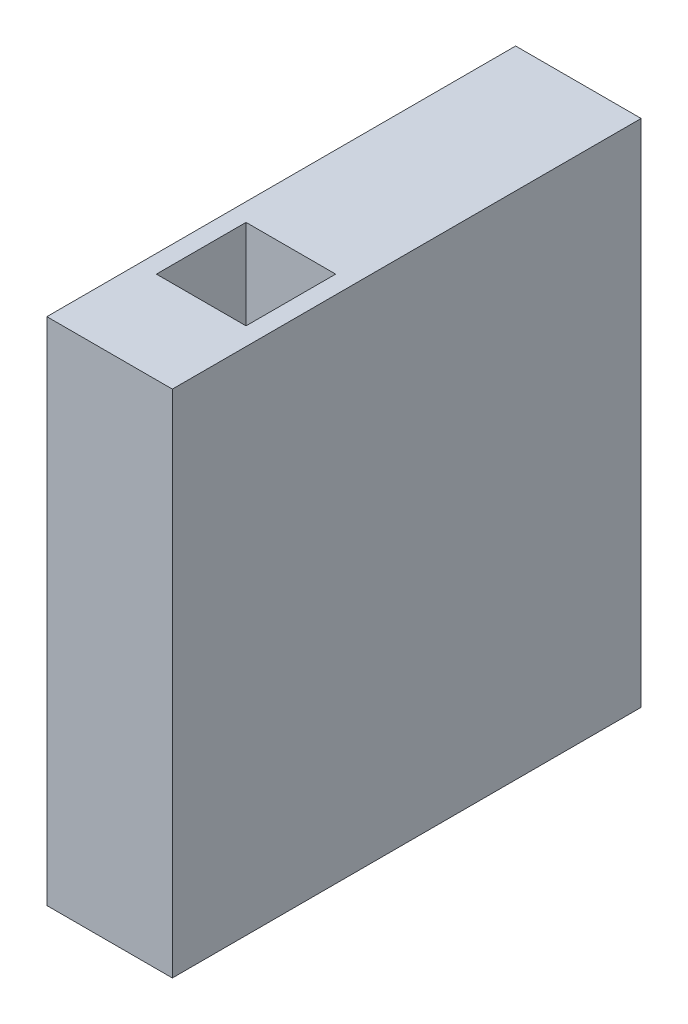
ISO-10303-21;
HEADER;
FILE_DESCRIPTION(('STEP AP214'),'2;1');
FILE_NAME('part.step','',(''),(''),'','','');
FILE_SCHEMA(('AUTOMOTIVE_DESIGN { 1 0 10303 214 1 1 1 1 }'));
ENDSEC;
DATA;
#1=APPLICATION_CONTEXT('core data for automotive mechanical design processes');
#2=APPLICATION_PROTOCOL_DEFINITION('international standard','automotive_design',2000,#1);
#3=PRODUCT_CONTEXT('',#1,'mechanical');
#4=PRODUCT('Part','Part','',(#3));
#5=PRODUCT_RELATED_PRODUCT_CATEGORY('part','',(#4));
#6=PRODUCT_DEFINITION_FORMATION('','',#4);
#7=PRODUCT_DEFINITION_CONTEXT('part definition',#1,'design');
#8=PRODUCT_DEFINITION('design','',#6,#7);
#9=PRODUCT_DEFINITION_SHAPE('','',#8);
#10=(LENGTH_UNIT() NAMED_UNIT(*) SI_UNIT(.MILLI.,.METRE.));
#11=(NAMED_UNIT(*) PLANE_ANGLE_UNIT() SI_UNIT($,.RADIAN.));
#12=(NAMED_UNIT(*) SI_UNIT($,.STERADIAN.) SOLID_ANGLE_UNIT());
#13=UNCERTAINTY_MEASURE_WITH_UNIT(LENGTH_MEASURE(1.E-05),#10,'distance_accuracy_value','');
#14=(GEOMETRIC_REPRESENTATION_CONTEXT(3) GLOBAL_UNCERTAINTY_ASSIGNED_CONTEXT((#13)) GLOBAL_UNIT_ASSIGNED_CONTEXT((#10,
#11,#12)) REPRESENTATION_CONTEXT('',''));
#15=CARTESIAN_POINT('',(0.,0.,0.));
#16=DIRECTION('',(0.,0.,1.));
#17=DIRECTION('',(1.,0.,0.));
#18=AXIS2_PLACEMENT_3D('',#15,#16,#17);
#19=CARTESIAN_POINT('',(0.,56.9,0.));
#20=DIRECTION('',(0.,1.,0.));
#21=DIRECTION('',(0.,0.,1.));
#22=AXIS2_PLACEMENT_3D('',#19,#20,#21);
#23=PLANE('',#22);
#24=DIRECTION('',(0.,0.,-1.));
#25=VECTOR('',#24,1.);
#26=CARTESIAN_POINT('',(7.,56.9,-26.15));
#27=LINE('',#26,#25);
#28=CARTESIAN_POINT('',(7.,56.9,26.15));
#29=VERTEX_POINT('',#28);
#30=CARTESIAN_POINT('',(7.,56.9,-26.15));
#31=VERTEX_POINT('',#30);
#32=EDGE_CURVE('E136',#29,#31,#27,.T.);
#33=ORIENTED_EDGE('',*,*,#32,.T.);
#34=DIRECTION('',(-1.,0.,0.));
#35=VECTOR('',#34,1.);
#36=CARTESIAN_POINT('',(-7.,56.9,-26.15));
#37=LINE('',#36,#35);
#38=CARTESIAN_POINT('',(-7.,56.9,-26.15));
#39=VERTEX_POINT('',#38);
#40=EDGE_CURVE('E139',#31,#39,#37,.T.);
#41=ORIENTED_EDGE('',*,*,#40,.T.);
#42=DIRECTION('',(0.,0.,1.));
#43=VECTOR('',#42,1.);
#44=CARTESIAN_POINT('',(-7.,56.9,-26.15));
#45=LINE('',#44,#43);
#46=CARTESIAN_POINT('',(-7.,56.9,26.15));
#47=VERTEX_POINT('',#46);
#48=EDGE_CURVE('E142',#39,#47,#45,.T.);
#49=ORIENTED_EDGE('',*,*,#48,.T.);
#50=DIRECTION('',(1.,0.,0.));
#51=VECTOR('',#50,1.);
#52=CARTESIAN_POINT('',(-7.,56.9,26.15));
#53=LINE('',#52,#51);
#54=EDGE_CURVE('E144',#47,#29,#53,.T.);
#55=ORIENTED_EDGE('',*,*,#54,.T.);
#56=EDGE_LOOP('',(#33,#41,#49,#55));
#57=FACE_BOUND('',#56,.T.);
#58=DIRECTION('',(1.,0.,0.));
#59=VECTOR('',#58,1.);
#60=CARTESIAN_POINT('',(0.,56.9,5.93));
#61=LINE('',#60,#59);
#62=CARTESIAN_POINT('',(-5.,56.9,5.93));
#63=VERTEX_POINT('',#62);
#64=CARTESIAN_POINT('',(5.,56.9,5.93));
#65=VERTEX_POINT('',#64);
#66=EDGE_CURVE('E126',#63,#65,#61,.T.);
#67=ORIENTED_EDGE('',*,*,#66,.T.);
#68=DIRECTION('',(0.,0.,1.));
#69=VECTOR('',#68,1.);
#70=CARTESIAN_POINT('',(5.,56.9,0.));
#71=LINE('',#70,#69);
#72=CARTESIAN_POINT('',(5.,56.9,15.93));
#73=VERTEX_POINT('',#72);
#74=EDGE_CURVE('E50',#65,#73,#71,.T.);
#75=ORIENTED_EDGE('',*,*,#74,.T.);
#76=DIRECTION('',(1.,0.,0.));
#77=VECTOR('',#76,1.);
#78=CARTESIAN_POINT('',(0.,56.9,15.93));
#79=LINE('',#78,#77);
#80=CARTESIAN_POINT('',(-5.,56.9,15.93));
#81=VERTEX_POINT('',#80);
#82=EDGE_CURVE('E117',#81,#73,#79,.T.);
#83=ORIENTED_EDGE('',*,*,#82,.F.);
#84=DIRECTION('',(0.,0.,1.));
#85=VECTOR('',#84,1.);
#86=CARTESIAN_POINT('',(-5.,56.9,0.));
#87=LINE('',#86,#85);
#88=EDGE_CURVE('E120',#63,#81,#87,.T.);
#89=ORIENTED_EDGE('',*,*,#88,.F.);
#90=EDGE_LOOP('',(#67,#75,#83,#89));
#91=FACE_BOUND('',#90,.T.);
#92=ADVANCED_FACE('F35',(#57,#91),#23,.T.);
#93=CARTESIAN_POINT('',(0.,0.,0.));
#94=DIRECTION('',(0.,1.,0.));
#95=DIRECTION('',(0.,0.,1.));
#96=AXIS2_PLACEMENT_3D('',#93,#94,#95);
#97=PLANE('',#96);
#98=DIRECTION('',(0.,0.,-1.));
#99=VECTOR('',#98,1.);
#100=CARTESIAN_POINT('',(7.,0.,-26.15));
#101=LINE('',#100,#99);
#102=CARTESIAN_POINT('',(7.,0.,26.15));
#103=VERTEX_POINT('',#102);
#104=CARTESIAN_POINT('',(7.,0.,-26.15));
#105=VERTEX_POINT('',#104);
#106=EDGE_CURVE('E132',#103,#105,#101,.T.);
#107=ORIENTED_EDGE('',*,*,#106,.F.);
#108=DIRECTION('',(1.,0.,0.));
#109=VECTOR('',#108,1.);
#110=CARTESIAN_POINT('',(-7.,0.,26.15));
#111=LINE('',#110,#109);
#112=CARTESIAN_POINT('',(-7.,0.,26.15));
#113=VERTEX_POINT('',#112);
#114=EDGE_CURVE('E140',#113,#103,#111,.T.);
#115=ORIENTED_EDGE('',*,*,#114,.F.);
#116=DIRECTION('',(0.,0.,1.));
#117=VECTOR('',#116,1.);
#118=CARTESIAN_POINT('',(-7.,0.,-26.15));
#119=LINE('',#118,#117);
#120=CARTESIAN_POINT('',(-7.,0.,-26.15));
#121=VERTEX_POINT('',#120);
#122=EDGE_CURVE('E151',#121,#113,#119,.T.);
#123=ORIENTED_EDGE('',*,*,#122,.F.);
#124=DIRECTION('',(-1.,0.,0.));
#125=VECTOR('',#124,1.);
#126=CARTESIAN_POINT('',(-7.,0.,-26.15));
#127=LINE('',#126,#125);
#128=EDGE_CURVE('E149',#105,#121,#127,.T.);
#129=ORIENTED_EDGE('',*,*,#128,.F.);
#130=EDGE_LOOP('',(#107,#115,#123,#129));
#131=FACE_BOUND('',#130,.T.);
#132=DIRECTION('',(0.,0.,1.));
#133=VECTOR('',#132,1.);
#134=CARTESIAN_POINT('',(5.,0.,0.));
#135=LINE('',#134,#133);
#136=CARTESIAN_POINT('',(5.,0.,5.93));
#137=VERTEX_POINT('',#136);
#138=CARTESIAN_POINT('',(5.,0.,15.93));
#139=VERTEX_POINT('',#138);
#140=EDGE_CURVE('E108',#137,#139,#135,.T.);
#141=ORIENTED_EDGE('',*,*,#140,.F.);
#142=DIRECTION('',(1.,0.,0.));
#143=VECTOR('',#142,1.);
#144=CARTESIAN_POINT('',(0.,0.,5.93));
#145=LINE('',#144,#143);
#146=CARTESIAN_POINT('',(-5.,0.,5.93));
#147=VERTEX_POINT('',#146);
#148=EDGE_CURVE('E100',#147,#137,#145,.T.);
#149=ORIENTED_EDGE('',*,*,#148,.F.);
#150=DIRECTION('',(0.,0.,1.));
#151=VECTOR('',#150,1.);
#152=CARTESIAN_POINT('',(-5.,0.,0.));
#153=LINE('',#152,#151);
#154=CARTESIAN_POINT('',(-5.,0.,15.93));
#155=VERTEX_POINT('',#154);
#156=EDGE_CURVE('E58',#147,#155,#153,.T.);
#157=ORIENTED_EDGE('',*,*,#156,.T.);
#158=DIRECTION('',(1.,0.,0.));
#159=VECTOR('',#158,1.);
#160=CARTESIAN_POINT('',(0.,0.,15.93));
#161=LINE('',#160,#159);
#162=EDGE_CURVE('E112',#155,#139,#161,.T.);
#163=ORIENTED_EDGE('',*,*,#162,.T.);
#164=EDGE_LOOP('',(#141,#149,#157,#163));
#165=FACE_BOUND('',#164,.T.);
#166=ADVANCED_FACE('F115',(#131,#165),#97,.F.);
#167=CARTESIAN_POINT('',(7.,56.9,-26.15));
#168=DIRECTION('',(-1.,0.,0.));
#169=DIRECTION('',(0.,0.,1.));
#170=AXIS2_PLACEMENT_3D('',#167,#168,#169);
#171=PLANE('',#170);
#172=ORIENTED_EDGE('',*,*,#106,.T.);
#173=DIRECTION('',(0.,-1.,0.));
#174=VECTOR('',#173,1.);
#175=CARTESIAN_POINT('',(7.,56.9,-26.15));
#176=LINE('',#175,#174);
#177=EDGE_CURVE('E11',#31,#105,#176,.T.);
#178=ORIENTED_EDGE('',*,*,#177,.F.);
#179=ORIENTED_EDGE('',*,*,#32,.F.);
#180=DIRECTION('',(0.,-1.,0.));
#181=VECTOR('',#180,1.);
#182=CARTESIAN_POINT('',(7.,56.9,26.15));
#183=LINE('',#182,#181);
#184=EDGE_CURVE('E146',#29,#103,#183,.T.);
#185=ORIENTED_EDGE('',*,*,#184,.T.);
#186=EDGE_LOOP('',(#172,#178,#179,#185));
#187=FACE_BOUND('',#186,.T.);
#188=ADVANCED_FACE('F37',(#187),#171,.F.);
#189=CARTESIAN_POINT('',(-7.,56.9,-26.15));
#190=DIRECTION('',(0.,0.,1.));
#191=DIRECTION('',(1.,0.,0.));
#192=AXIS2_PLACEMENT_3D('',#189,#190,#191);
#193=PLANE('',#192);
#194=ORIENTED_EDGE('',*,*,#128,.T.);
#195=DIRECTION('',(0.,-1.,0.));
#196=VECTOR('',#195,1.);
#197=CARTESIAN_POINT('',(-7.,56.9,-26.15));
#198=LINE('',#197,#196);
#199=EDGE_CURVE('E43',#39,#121,#198,.T.);
#200=ORIENTED_EDGE('',*,*,#199,.F.);
#201=ORIENTED_EDGE('',*,*,#40,.F.);
#202=ORIENTED_EDGE('',*,*,#177,.T.);
#203=EDGE_LOOP('',(#194,#200,#201,#202));
#204=FACE_BOUND('',#203,.T.);
#205=ADVANCED_FACE('F178',(#204),#193,.F.);
#206=CARTESIAN_POINT('',(-7.,56.9,-26.15));
#207=DIRECTION('',(1.,0.,0.));
#208=DIRECTION('',(0.,0.,-1.));
#209=AXIS2_PLACEMENT_3D('',#206,#207,#208);
#210=PLANE('',#209);
#211=ORIENTED_EDGE('',*,*,#122,.T.);
#212=DIRECTION('',(0.,-1.,0.));
#213=VECTOR('',#212,1.);
#214=CARTESIAN_POINT('',(-7.,56.9,26.15));
#215=LINE('',#214,#213);
#216=EDGE_CURVE('E156',#47,#113,#215,.T.);
#217=ORIENTED_EDGE('',*,*,#216,.F.);
#218=ORIENTED_EDGE('',*,*,#48,.F.);
#219=ORIENTED_EDGE('',*,*,#199,.T.);
#220=EDGE_LOOP('',(#211,#217,#218,#219));
#221=FACE_BOUND('',#220,.T.);
#222=ADVANCED_FACE('F163',(#221),#210,.F.);
#223=CARTESIAN_POINT('',(-7.,56.9,26.15));
#224=DIRECTION('',(0.,0.,-1.));
#225=DIRECTION('',(-1.,0.,0.));
#226=AXIS2_PLACEMENT_3D('',#223,#224,#225);
#227=PLANE('',#226);
#228=ORIENTED_EDGE('',*,*,#114,.T.);
#229=ORIENTED_EDGE('',*,*,#184,.F.);
#230=ORIENTED_EDGE('',*,*,#54,.F.);
#231=ORIENTED_EDGE('',*,*,#216,.T.);
#232=EDGE_LOOP('',(#228,#229,#230,#231));
#233=FACE_BOUND('',#232,.T.);
#234=ADVANCED_FACE('F171',(#233),#227,.F.);
#235=CARTESIAN_POINT('',(5.,0.,0.));
#236=DIRECTION('',(-1.,0.,0.));
#237=DIRECTION('',(0.,0.,1.));
#238=AXIS2_PLACEMENT_3D('',#235,#236,#237);
#239=PLANE('',#238);
#240=ORIENTED_EDGE('',*,*,#74,.F.);
#241=DIRECTION('',(0.,1.,0.));
#242=VECTOR('',#241,1.);
#243=CARTESIAN_POINT('',(5.,0.,5.93));
#244=LINE('',#243,#242);
#245=EDGE_CURVE('E103',#137,#65,#244,.T.);
#246=ORIENTED_EDGE('',*,*,#245,.F.);
#247=ORIENTED_EDGE('',*,*,#140,.T.);
#248=DIRECTION('',(0.,1.,0.));
#249=VECTOR('',#248,1.);
#250=CARTESIAN_POINT('',(5.,0.,15.93));
#251=LINE('',#250,#249);
#252=EDGE_CURVE('E130',#139,#73,#251,.T.);
#253=ORIENTED_EDGE('',*,*,#252,.T.);
#254=EDGE_LOOP('',(#240,#246,#247,#253));
#255=FACE_BOUND('',#254,.T.);
#256=ADVANCED_FACE('F110',(#255),#239,.T.);
#257=CARTESIAN_POINT('',(0.,0.,15.93));
#258=DIRECTION('',(0.,0.,1.));
#259=DIRECTION('',(1.,0.,0.));
#260=AXIS2_PLACEMENT_3D('',#257,#258,#259);
#261=PLANE('',#260);
#262=ORIENTED_EDGE('',*,*,#82,.T.);
#263=ORIENTED_EDGE('',*,*,#252,.F.);
#264=ORIENTED_EDGE('',*,*,#162,.F.);
#265=DIRECTION('',(0.,1.,0.));
#266=VECTOR('',#265,1.);
#267=CARTESIAN_POINT('',(-5.,0.,15.93));
#268=LINE('',#267,#266);
#269=EDGE_CURVE('E133',#155,#81,#268,.T.);
#270=ORIENTED_EDGE('',*,*,#269,.T.);
#271=EDGE_LOOP('',(#262,#263,#264,#270));
#272=FACE_BOUND('',#271,.T.);
#273=ADVANCED_FACE('F198',(#272),#261,.F.);
#274=CARTESIAN_POINT('',(-5.,0.,0.));
#275=DIRECTION('',(-1.,0.,0.));
#276=DIRECTION('',(0.,0.,1.));
#277=AXIS2_PLACEMENT_3D('',#274,#275,#276);
#278=PLANE('',#277);
#279=ORIENTED_EDGE('',*,*,#88,.T.);
#280=ORIENTED_EDGE('',*,*,#269,.F.);
#281=ORIENTED_EDGE('',*,*,#156,.F.);
#282=DIRECTION('',(0.,1.,0.));
#283=VECTOR('',#282,1.);
#284=CARTESIAN_POINT('',(-5.,0.,5.93));
#285=LINE('',#284,#283);
#286=EDGE_CURVE('E105',#147,#63,#285,.T.);
#287=ORIENTED_EDGE('',*,*,#286,.T.);
#288=EDGE_LOOP('',(#279,#280,#281,#287));
#289=FACE_BOUND('',#288,.T.);
#290=ADVANCED_FACE('F202',(#289),#278,.F.);
#291=CARTESIAN_POINT('',(0.,0.,5.93));
#292=DIRECTION('',(0.,0.,1.));
#293=DIRECTION('',(1.,0.,0.));
#294=AXIS2_PLACEMENT_3D('',#291,#292,#293);
#295=PLANE('',#294);
#296=ORIENTED_EDGE('',*,*,#66,.F.);
#297=ORIENTED_EDGE('',*,*,#286,.F.);
#298=ORIENTED_EDGE('',*,*,#148,.T.);
#299=ORIENTED_EDGE('',*,*,#245,.T.);
#300=EDGE_LOOP('',(#296,#297,#298,#299));
#301=FACE_BOUND('',#300,.T.);
#302=ADVANCED_FACE('F102',(#301),#295,.T.);
#303=CLOSED_SHELL('',(#92,#166,#188,#205,#222,#234,#256,#273,#290,#302));
#304=MANIFOLD_SOLID_BREP('B2',#303);
#305=ADVANCED_BREP_SHAPE_REPRESENTATION('',(#18,#304),#14);
#306=SHAPE_DEFINITION_REPRESENTATION(#9,#305);
ENDSEC;
END-ISO-10303-21;
